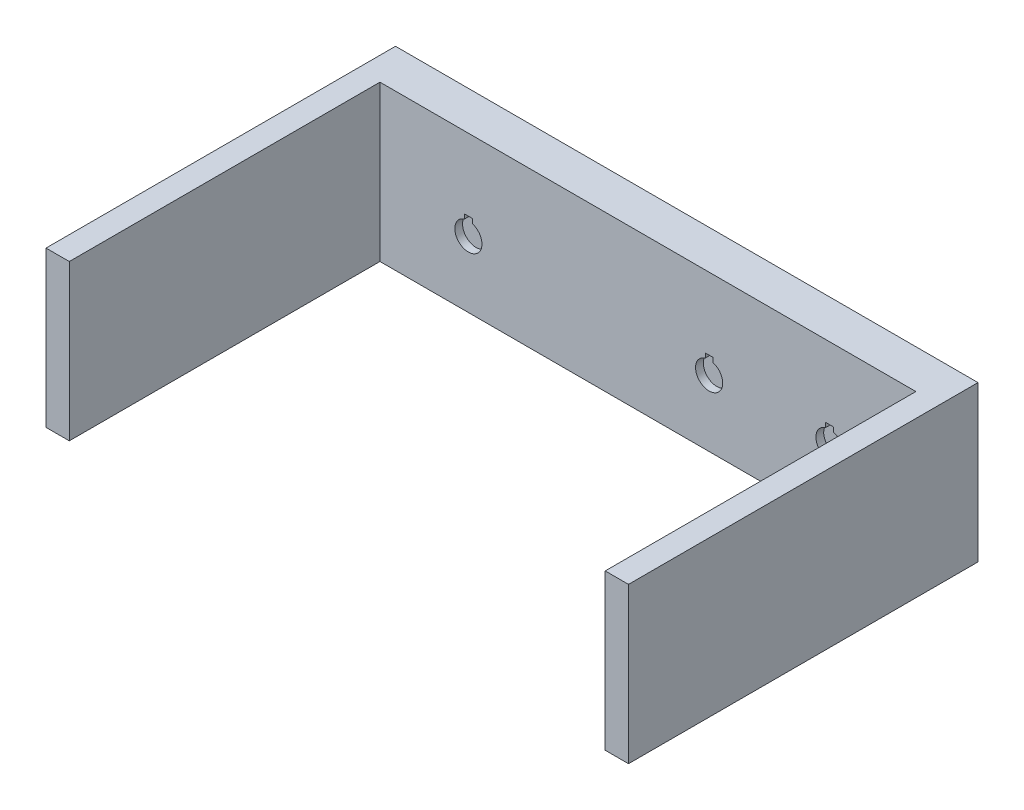
ISO-10303-21;
HEADER;
FILE_DESCRIPTION(('STEP AP214'),'2;1');
FILE_NAME('part.step','',(''),(''),'','','');
FILE_SCHEMA(('AUTOMOTIVE_DESIGN { 1 0 10303 214 1 1 1 1 }'));
ENDSEC;
DATA;
#1=APPLICATION_CONTEXT('core data for automotive mechanical design processes');
#2=APPLICATION_PROTOCOL_DEFINITION('international standard','automotive_design',2000,#1);
#3=PRODUCT_CONTEXT('',#1,'mechanical');
#4=PRODUCT('Part','Part','',(#3));
#5=PRODUCT_RELATED_PRODUCT_CATEGORY('part','',(#4));
#6=PRODUCT_DEFINITION_FORMATION('','',#4);
#7=PRODUCT_DEFINITION_CONTEXT('part definition',#1,'design');
#8=PRODUCT_DEFINITION('design','',#6,#7);
#9=PRODUCT_DEFINITION_SHAPE('','',#8);
#10=(LENGTH_UNIT() NAMED_UNIT(*) SI_UNIT(.MILLI.,.METRE.));
#11=(NAMED_UNIT(*) PLANE_ANGLE_UNIT() SI_UNIT($,.RADIAN.));
#12=(NAMED_UNIT(*) SI_UNIT($,.STERADIAN.) SOLID_ANGLE_UNIT());
#13=UNCERTAINTY_MEASURE_WITH_UNIT(LENGTH_MEASURE(1.E-05),#10,'distance_accuracy_value','');
#14=(GEOMETRIC_REPRESENTATION_CONTEXT(3) GLOBAL_UNCERTAINTY_ASSIGNED_CONTEXT((#13)) GLOBAL_UNIT_ASSIGNED_CONTEXT((#10,
#11,#12)) REPRESENTATION_CONTEXT('',''));
#15=CARTESIAN_POINT('',(0.,0.,0.));
#16=DIRECTION('',(0.,0.,1.));
#17=DIRECTION('',(1.,0.,0.));
#18=AXIS2_PLACEMENT_3D('',#15,#16,#17);
#19=CARTESIAN_POINT('',(0.,0.,10.));
#20=DIRECTION('',(0.,0.,1.));
#21=DIRECTION('',(1.,0.,0.));
#22=AXIS2_PLACEMENT_3D('',#19,#20,#21);
#23=PLANE('',#22);
#24=DIRECTION('',(0.,-1.,0.));
#25=VECTOR('',#24,1.);
#26=CARTESIAN_POINT('',(-47.2341755128517,1.50410196624967,10.));
#27=LINE('',#26,#25);
#28=CARTESIAN_POINT('',(-47.2341755128517,1.50410196624967,10.));
#29=VERTEX_POINT('',#28);
#30=CARTESIAN_POINT('',(-47.2341755128517,0.354101966249675,10.));
#31=VERTEX_POINT('',#30);
#32=EDGE_CURVE('E252',#29,#31,#27,.T.);
#33=ORIENTED_EDGE('',*,*,#32,.F.);
#34=DIRECTION('',(-1.,0.,0.));
#35=VECTOR('',#34,1.);
#36=CARTESIAN_POINT('',(-45.2341755128517,1.50410196624968,10.));
#37=LINE('',#36,#35);
#38=CARTESIAN_POINT('',(-45.2341755128517,1.50410196624968,10.));
#39=VERTEX_POINT('',#38);
#40=EDGE_CURVE('E251',#39,#29,#37,.T.);
#41=ORIENTED_EDGE('',*,*,#40,.F.);
#42=DIRECTION('',(0.,-1.,0.));
#43=VECTOR('',#42,1.);
#44=CARTESIAN_POINT('',(-45.2341755128517,1.50410196624968,10.));
#45=LINE('',#44,#43);
#46=CARTESIAN_POINT('',(-45.2341755128517,0.354101966249675,10.));
#47=VERTEX_POINT('',#46);
#48=EDGE_CURVE('E258',#39,#47,#45,.T.);
#49=ORIENTED_EDGE('',*,*,#48,.T.);
#50=CARTESIAN_POINT('',(-46.2341755128517,-3.00000000000001,10.));
#51=DIRECTION('',(0.,0.,1.));
#52=DIRECTION('',(1.,0.,0.));
#53=AXIS2_PLACEMENT_3D('',#50,#51,#52);
#54=CIRCLE('',#53,3.5);
#55=EDGE_CURVE('E254',#31,#47,#54,.T.);
#56=ORIENTED_EDGE('',*,*,#55,.F.);
#57=EDGE_LOOP('',(#33,#41,#49,#56));
#58=FACE_BOUND('',#57,.T.);
#59=DIRECTION('',(-1.,0.,0.));
#60=VECTOR('',#59,1.);
#61=CARTESIAN_POINT('',(16.7658244871483,1.50410196624968,10.));
#62=LINE('',#61,#60);
#63=CARTESIAN_POINT('',(16.7658244871483,1.50410196624968,10.));
#64=VERTEX_POINT('',#63);
#65=CARTESIAN_POINT('',(14.7658244871483,1.50410196624967,10.));
#66=VERTEX_POINT('',#65);
#67=EDGE_CURVE('E255',#64,#66,#62,.T.);
#68=ORIENTED_EDGE('',*,*,#67,.F.);
#69=DIRECTION('',(0.,-1.,0.));
#70=VECTOR('',#69,1.);
#71=CARTESIAN_POINT('',(16.7658244871483,1.50410196624968,10.));
#72=LINE('',#71,#70);
#73=CARTESIAN_POINT('',(16.7658244871483,0.354101966249675,10.));
#74=VERTEX_POINT('',#73);
#75=EDGE_CURVE('E283',#64,#74,#72,.T.);
#76=ORIENTED_EDGE('',*,*,#75,.T.);
#77=CARTESIAN_POINT('',(15.7658244871483,-3.00000000000001,10.));
#78=DIRECTION('',(0.,0.,1.));
#79=DIRECTION('',(1.,0.,0.));
#80=AXIS2_PLACEMENT_3D('',#77,#78,#79);
#81=CIRCLE('',#80,3.5);
#82=CARTESIAN_POINT('',(14.7658244871483,0.354101966249675,10.));
#83=VERTEX_POINT('',#82);
#84=EDGE_CURVE('E286',#83,#74,#81,.T.);
#85=ORIENTED_EDGE('',*,*,#84,.F.);
#86=DIRECTION('',(0.,-1.,0.));
#87=VECTOR('',#86,1.);
#88=CARTESIAN_POINT('',(14.7658244871483,1.50410196624967,10.));
#89=LINE('',#88,#87);
#90=EDGE_CURVE('E289',#66,#83,#89,.T.);
#91=ORIENTED_EDGE('',*,*,#90,.F.);
#92=EDGE_LOOP('',(#68,#76,#85,#91));
#93=FACE_BOUND('',#92,.T.);
#94=DIRECTION('',(-1.,0.,0.));
#95=VECTOR('',#94,1.);
#96=CARTESIAN_POINT('',(47.7658244871483,1.50410196624968,10.));
#97=LINE('',#96,#95);
#98=CARTESIAN_POINT('',(47.7658244871483,1.50410196624968,10.));
#99=VERTEX_POINT('',#98);
#100=CARTESIAN_POINT('',(45.7658244871483,1.50410196624967,10.));
#101=VERTEX_POINT('',#100);
#102=EDGE_CURVE('E282',#99,#101,#97,.T.);
#103=ORIENTED_EDGE('',*,*,#102,.F.);
#104=DIRECTION('',(0.,-1.,0.));
#105=VECTOR('',#104,1.);
#106=CARTESIAN_POINT('',(47.7658244871483,1.50410196624968,10.));
#107=LINE('',#106,#105);
#108=CARTESIAN_POINT('',(47.7658244871483,0.354101966249675,10.));
#109=VERTEX_POINT('',#108);
#110=EDGE_CURVE('E304',#99,#109,#107,.T.);
#111=ORIENTED_EDGE('',*,*,#110,.T.);
#112=CARTESIAN_POINT('',(46.7658244871483,-3.00000000000001,10.));
#113=DIRECTION('',(0.,0.,1.));
#114=DIRECTION('',(1.,0.,0.));
#115=AXIS2_PLACEMENT_3D('',#112,#113,#114);
#116=CIRCLE('',#115,3.5);
#117=CARTESIAN_POINT('',(45.7658244871483,0.354101966249675,10.));
#118=VERTEX_POINT('',#117);
#119=EDGE_CURVE('E307',#118,#109,#116,.T.);
#120=ORIENTED_EDGE('',*,*,#119,.F.);
#121=DIRECTION('',(0.,-1.,0.));
#122=VECTOR('',#121,1.);
#123=CARTESIAN_POINT('',(45.7658244871483,1.50410196624967,10.));
#124=LINE('',#123,#122);
#125=EDGE_CURVE('E310',#101,#118,#124,.T.);
#126=ORIENTED_EDGE('',*,*,#125,.F.);
#127=EDGE_LOOP('',(#103,#111,#120,#126));
#128=FACE_BOUND('',#127,.T.);
#129=DIRECTION('',(1.,0.,0.));
#130=VECTOR('',#129,1.);
#131=CARTESIAN_POINT('',(75.,-20.,10.));
#132=LINE('',#131,#130);
#133=CARTESIAN_POINT('',(-69.,-20.,10.));
#134=VERTEX_POINT('',#133);
#135=CARTESIAN_POINT('',(69.,-20.,10.));
#136=VERTEX_POINT('',#135);
#137=EDGE_CURVE('E53',#134,#136,#132,.T.);
#138=ORIENTED_EDGE('',*,*,#137,.T.);
#139=DIRECTION('',(0.,-1.,0.));
#140=VECTOR('',#139,1.);
#141=CARTESIAN_POINT('',(69.,20.,10.));
#142=LINE('',#141,#140);
#143=CARTESIAN_POINT('',(69.,20.,10.));
#144=VERTEX_POINT('',#143);
#145=EDGE_CURVE('E48',#144,#136,#142,.T.);
#146=ORIENTED_EDGE('',*,*,#145,.F.);
#147=DIRECTION('',(-1.,0.,0.));
#148=VECTOR('',#147,1.);
#149=CARTESIAN_POINT('',(75.,20.,10.));
#150=LINE('',#149,#148);
#151=CARTESIAN_POINT('',(-69.,20.,10.));
#152=VERTEX_POINT('',#151);
#153=EDGE_CURVE('E383',#144,#152,#150,.T.);
#154=ORIENTED_EDGE('',*,*,#153,.T.);
#155=DIRECTION('',(0.,1.,0.));
#156=VECTOR('',#155,1.);
#157=CARTESIAN_POINT('',(-69.,20.,10.));
#158=LINE('',#157,#156);
#159=EDGE_CURVE('E227',#134,#152,#158,.T.);
#160=ORIENTED_EDGE('',*,*,#159,.F.);
#161=EDGE_LOOP('',(#138,#146,#154,#160));
#162=FACE_BOUND('',#161,.T.);
#163=ADVANCED_FACE('F33',(#58,#93,#128,#162),#23,.T.);
#164=CARTESIAN_POINT('',(-75.,-20.,10.));
#165=DIRECTION('',(1.,0.,0.));
#166=DIRECTION('',(0.,0.,-1.));
#167=AXIS2_PLACEMENT_3D('',#164,#165,#166);
#168=PLANE('',#167);
#169=DIRECTION('',(0.,-1.,0.));
#170=VECTOR('',#169,1.);
#171=CARTESIAN_POINT('',(-75.,-20.,0.));
#172=LINE('',#171,#170);
#173=CARTESIAN_POINT('',(-75.,20.,0.));
#174=VERTEX_POINT('',#173);
#175=CARTESIAN_POINT('',(-75.,-20.,0.));
#176=VERTEX_POINT('',#175);
#177=EDGE_CURVE('E375',#174,#176,#172,.T.);
#178=ORIENTED_EDGE('',*,*,#177,.T.);
#179=DIRECTION('',(0.,0.,-1.));
#180=VECTOR('',#179,1.);
#181=CARTESIAN_POINT('',(-75.,-20.,10.));
#182=LINE('',#181,#180);
#183=CARTESIAN_POINT('',(-75.,-20.,90.));
#184=VERTEX_POINT('',#183);
#185=EDGE_CURVE('E395',#184,#176,#182,.T.);
#186=ORIENTED_EDGE('',*,*,#185,.F.);
#187=DIRECTION('',(0.,-1.,0.));
#188=VECTOR('',#187,1.);
#189=CARTESIAN_POINT('',(-75.,20.,90.));
#190=LINE('',#189,#188);
#191=CARTESIAN_POINT('',(-75.,20.,90.));
#192=VERTEX_POINT('',#191);
#193=EDGE_CURVE('E228',#192,#184,#190,.T.);
#194=ORIENTED_EDGE('',*,*,#193,.F.);
#195=DIRECTION('',(0.,0.,-1.));
#196=VECTOR('',#195,1.);
#197=CARTESIAN_POINT('',(-75.,20.,10.));
#198=LINE('',#197,#196);
#199=EDGE_CURVE('E203',#192,#174,#198,.T.);
#200=ORIENTED_EDGE('',*,*,#199,.T.);
#201=EDGE_LOOP('',(#178,#186,#194,#200));
#202=FACE_BOUND('',#201,.T.);
#203=ADVANCED_FACE('F35',(#202),#168,.F.);
#204=CARTESIAN_POINT('',(75.,-20.,10.));
#205=DIRECTION('',(0.,1.,0.));
#206=DIRECTION('',(-1.,0.,0.));
#207=AXIS2_PLACEMENT_3D('',#204,#205,#206);
#208=PLANE('',#207);
#209=DIRECTION('',(1.,0.,0.));
#210=VECTOR('',#209,1.);
#211=CARTESIAN_POINT('',(65.2658244871483,-20.,2.00000000000001));
#212=LINE('',#211,#210);
#213=CARTESIAN_POINT('',(-64.7341755128516,-20.,1.99999999999999));
#214=VERTEX_POINT('',#213);
#215=CARTESIAN_POINT('',(65.2658244871483,-20.,2.00000000000001));
#216=VERTEX_POINT('',#215);
#217=EDGE_CURVE('E365',#214,#216,#212,.T.);
#218=ORIENTED_EDGE('',*,*,#217,.F.);
#219=DIRECTION('',(0.,0.,-1.));
#220=VECTOR('',#219,1.);
#221=CARTESIAN_POINT('',(-64.7341755128517,-20.,1.99999999999999));
#222=LINE('',#221,#220);
#223=CARTESIAN_POINT('',(-64.7341755128517,-20.,7.99999999999999));
#224=VERTEX_POINT('',#223);
#225=EDGE_CURVE('E349',#224,#214,#222,.T.);
#226=ORIENTED_EDGE('',*,*,#225,.F.);
#227=DIRECTION('',(-1.,0.,0.));
#228=VECTOR('',#227,1.);
#229=CARTESIAN_POINT('',(65.2658244871483,-20.,8.00000000000001));
#230=LINE('',#229,#228);
#231=CARTESIAN_POINT('',(65.2658244871483,-20.,8.00000000000001));
#232=VERTEX_POINT('',#231);
#233=EDGE_CURVE('E354',#232,#224,#230,.T.);
#234=ORIENTED_EDGE('',*,*,#233,.F.);
#235=DIRECTION('',(0.,0.,1.));
#236=VECTOR('',#235,1.);
#237=CARTESIAN_POINT('',(65.2658244871483,-20.,2.00000000000001));
#238=LINE('',#237,#236);
#239=EDGE_CURVE('E368',#216,#232,#238,.T.);
#240=ORIENTED_EDGE('',*,*,#239,.F.);
#241=EDGE_LOOP('',(#218,#226,#234,#240));
#242=FACE_BOUND('',#241,.T.);
#243=DIRECTION('',(1.,0.,0.));
#244=VECTOR('',#243,1.);
#245=CARTESIAN_POINT('',(75.,-20.,0.));
#246=LINE('',#245,#244);
#247=CARTESIAN_POINT('',(75.,-20.,0.));
#248=VERTEX_POINT('',#247);
#249=EDGE_CURVE('E388',#176,#248,#246,.T.);
#250=ORIENTED_EDGE('',*,*,#249,.T.);
#251=DIRECTION('',(0.,0.,-1.));
#252=VECTOR('',#251,1.);
#253=CARTESIAN_POINT('',(75.,-20.,10.));
#254=LINE('',#253,#252);
#255=CARTESIAN_POINT('',(75.,-20.,90.));
#256=VERTEX_POINT('',#255);
#257=EDGE_CURVE('E202',#256,#248,#254,.T.);
#258=ORIENTED_EDGE('',*,*,#257,.F.);
#259=DIRECTION('',(1.,0.,0.));
#260=VECTOR('',#259,1.);
#261=CARTESIAN_POINT('',(75.,-20.,90.));
#262=LINE('',#261,#260);
#263=CARTESIAN_POINT('',(69.,-20.,90.));
#264=VERTEX_POINT('',#263);
#265=EDGE_CURVE('E217',#264,#256,#262,.T.);
#266=ORIENTED_EDGE('',*,*,#265,.F.);
#267=DIRECTION('',(0.,0.,-1.));
#268=VECTOR('',#267,1.);
#269=CARTESIAN_POINT('',(69.,-20.,90.));
#270=LINE('',#269,#268);
#271=EDGE_CURVE('E222',#264,#136,#270,.T.);
#272=ORIENTED_EDGE('',*,*,#271,.T.);
#273=ORIENTED_EDGE('',*,*,#137,.F.);
#274=DIRECTION('',(0.,0.,-1.));
#275=VECTOR('',#274,1.);
#276=CARTESIAN_POINT('',(-69.,-20.,90.));
#277=LINE('',#276,#275);
#278=CARTESIAN_POINT('',(-69.,-20.,90.));
#279=VERTEX_POINT('',#278);
#280=EDGE_CURVE('E243',#279,#134,#277,.T.);
#281=ORIENTED_EDGE('',*,*,#280,.F.);
#282=DIRECTION('',(1.,0.,0.));
#283=VECTOR('',#282,1.);
#284=CARTESIAN_POINT('',(-75.,-20.,90.));
#285=LINE('',#284,#283);
#286=EDGE_CURVE('E231',#184,#279,#285,.T.);
#287=ORIENTED_EDGE('',*,*,#286,.F.);
#288=ORIENTED_EDGE('',*,*,#185,.T.);
#289=EDGE_LOOP('',(#250,#258,#266,#272,#273,#281,#287,#288));
#290=FACE_BOUND('',#289,.T.);
#291=ADVANCED_FACE('F439',(#242,#290),#208,.F.);
#292=CARTESIAN_POINT('',(75.,-20.,10.));
#293=DIRECTION('',(-1.,0.,0.));
#294=DIRECTION('',(0.,0.,1.));
#295=AXIS2_PLACEMENT_3D('',#292,#293,#294);
#296=PLANE('',#295);
#297=DIRECTION('',(0.,1.,0.));
#298=VECTOR('',#297,1.);
#299=CARTESIAN_POINT('',(75.,-20.,0.));
#300=LINE('',#299,#298);
#301=CARTESIAN_POINT('',(75.,20.,0.));
#302=VERTEX_POINT('',#301);
#303=EDGE_CURVE('E199',#248,#302,#300,.T.);
#304=ORIENTED_EDGE('',*,*,#303,.T.);
#305=DIRECTION('',(0.,0.,-1.));
#306=VECTOR('',#305,1.);
#307=CARTESIAN_POINT('',(75.,20.,10.));
#308=LINE('',#307,#306);
#309=CARTESIAN_POINT('',(75.,20.,90.));
#310=VERTEX_POINT('',#309);
#311=EDGE_CURVE('E192',#310,#302,#308,.T.);
#312=ORIENTED_EDGE('',*,*,#311,.F.);
#313=DIRECTION('',(0.,1.,0.));
#314=VECTOR('',#313,1.);
#315=CARTESIAN_POINT('',(75.,20.,90.));
#316=LINE('',#315,#314);
#317=EDGE_CURVE('E197',#256,#310,#316,.T.);
#318=ORIENTED_EDGE('',*,*,#317,.F.);
#319=ORIENTED_EDGE('',*,*,#257,.T.);
#320=EDGE_LOOP('',(#304,#312,#318,#319));
#321=FACE_BOUND('',#320,.T.);
#322=ADVANCED_FACE('F194',(#321),#296,.F.);
#323=CARTESIAN_POINT('',(75.,20.,10.));
#324=DIRECTION('',(0.,-1.,0.));
#325=DIRECTION('',(1.,0.,0.));
#326=AXIS2_PLACEMENT_3D('',#323,#324,#325);
#327=PLANE('',#326);
#328=DIRECTION('',(-1.,0.,0.));
#329=VECTOR('',#328,1.);
#330=CARTESIAN_POINT('',(75.,20.,0.));
#331=LINE('',#330,#329);
#332=EDGE_CURVE('E384',#302,#174,#331,.T.);
#333=ORIENTED_EDGE('',*,*,#332,.T.);
#334=ORIENTED_EDGE('',*,*,#199,.F.);
#335=DIRECTION('',(-1.,0.,0.));
#336=VECTOR('',#335,1.);
#337=CARTESIAN_POINT('',(-75.,20.,90.));
#338=LINE('',#337,#336);
#339=CARTESIAN_POINT('',(-69.,20.,90.));
#340=VERTEX_POINT('',#339);
#341=EDGE_CURVE('E235',#340,#192,#338,.T.);
#342=ORIENTED_EDGE('',*,*,#341,.F.);
#343=DIRECTION('',(0.,0.,-1.));
#344=VECTOR('',#343,1.);
#345=CARTESIAN_POINT('',(-69.,20.,90.));
#346=LINE('',#345,#344);
#347=EDGE_CURVE('E238',#340,#152,#346,.T.);
#348=ORIENTED_EDGE('',*,*,#347,.T.);
#349=ORIENTED_EDGE('',*,*,#153,.F.);
#350=DIRECTION('',(0.,0.,-1.));
#351=VECTOR('',#350,1.);
#352=CARTESIAN_POINT('',(69.,20.,90.));
#353=LINE('',#352,#351);
#354=CARTESIAN_POINT('',(69.,20.,90.));
#355=VERTEX_POINT('',#354);
#356=EDGE_CURVE('E209',#355,#144,#353,.T.);
#357=ORIENTED_EDGE('',*,*,#356,.F.);
#358=DIRECTION('',(-1.,0.,0.));
#359=VECTOR('',#358,1.);
#360=CARTESIAN_POINT('',(75.,20.,90.));
#361=LINE('',#360,#359);
#362=EDGE_CURVE('E206',#310,#355,#361,.T.);
#363=ORIENTED_EDGE('',*,*,#362,.F.);
#364=ORIENTED_EDGE('',*,*,#311,.T.);
#365=EDGE_LOOP('',(#333,#334,#342,#348,#349,#357,#363,#364));
#366=FACE_BOUND('',#365,.T.);
#367=ADVANCED_FACE('F207',(#366),#327,.F.);
#368=CARTESIAN_POINT('',(0.,0.,0.));
#369=DIRECTION('',(0.,0.,1.));
#370=DIRECTION('',(1.,0.,0.));
#371=AXIS2_PLACEMENT_3D('',#368,#369,#370);
#372=PLANE('',#371);
#373=CARTESIAN_POINT('',(-46.2341755128517,-3.00000000000001,0.));
#374=DIRECTION('',(0.,0.,1.));
#375=DIRECTION('',(1.,0.,0.));
#376=AXIS2_PLACEMENT_3D('',#373,#374,#375);
#377=CIRCLE('',#376,3.5);
#378=CARTESIAN_POINT('',(-42.7341755128517,-3.00000000000001,0.));
#379=VERTEX_POINT('',#378);
#380=EDGE_CURVE('E247',#379,#379,#377,.T.);
#381=ORIENTED_EDGE('',*,*,#380,.T.);
#382=EDGE_LOOP('',(#381));
#383=FACE_BOUND('',#382,.T.);
#384=CARTESIAN_POINT('',(15.7658244871483,-3.00000000000001,0.));
#385=DIRECTION('',(0.,0.,1.));
#386=DIRECTION('',(1.,0.,0.));
#387=AXIS2_PLACEMENT_3D('',#384,#385,#386);
#388=CIRCLE('',#387,3.5);
#389=CARTESIAN_POINT('',(19.2658244871483,-3.00000000000001,0.));
#390=VERTEX_POINT('',#389);
#391=EDGE_CURVE('E275',#390,#390,#388,.T.);
#392=ORIENTED_EDGE('',*,*,#391,.T.);
#393=EDGE_LOOP('',(#392));
#394=FACE_BOUND('',#393,.T.);
#395=CARTESIAN_POINT('',(46.7658244871483,-3.00000000000001,0.));
#396=DIRECTION('',(0.,0.,1.));
#397=DIRECTION('',(1.,0.,0.));
#398=AXIS2_PLACEMENT_3D('',#395,#396,#397);
#399=CIRCLE('',#398,3.5);
#400=CARTESIAN_POINT('',(50.2658244871483,-3.00000000000001,0.));
#401=VERTEX_POINT('',#400);
#402=EDGE_CURVE('E298',#401,#401,#399,.T.);
#403=ORIENTED_EDGE('',*,*,#402,.T.);
#404=EDGE_LOOP('',(#403));
#405=FACE_BOUND('',#404,.T.);
#406=ORIENTED_EDGE('',*,*,#177,.F.);
#407=ORIENTED_EDGE('',*,*,#332,.F.);
#408=ORIENTED_EDGE('',*,*,#303,.F.);
#409=ORIENTED_EDGE('',*,*,#249,.F.);
#410=EDGE_LOOP('',(#406,#407,#408,#409));
#411=FACE_BOUND('',#410,.T.);
#412=ADVANCED_FACE('F415',(#383,#394,#405,#411),#372,.F.);
#413=CARTESIAN_POINT('',(-64.7341755128517,14.,1.99999999999999));
#414=DIRECTION('',(-1.,0.,0.));
#415=DIRECTION('',(0.,-1.,0.));
#416=AXIS2_PLACEMENT_3D('',#413,#414,#415);
#417=PLANE('',#416);
#418=ORIENTED_EDGE('',*,*,#225,.T.);
#419=DIRECTION('',(0.,-1.,0.));
#420=VECTOR('',#419,1.);
#421=CARTESIAN_POINT('',(-64.7341755128517,14.,1.99999999999999));
#422=LINE('',#421,#420);
#423=CARTESIAN_POINT('',(-64.7341755128517,14.,1.99999999999999));
#424=VERTEX_POINT('',#423);
#425=EDGE_CURVE('E363',#424,#214,#422,.T.);
#426=ORIENTED_EDGE('',*,*,#425,.F.);
#427=DIRECTION('',(0.,0.,-1.));
#428=VECTOR('',#427,1.);
#429=CARTESIAN_POINT('',(-64.7341755128517,14.,1.99999999999999));
#430=LINE('',#429,#428);
#431=CARTESIAN_POINT('',(-64.7341755128517,14.,7.99999999999999));
#432=VERTEX_POINT('',#431);
#433=EDGE_CURVE('E350',#432,#424,#430,.T.);
#434=ORIENTED_EDGE('',*,*,#433,.F.);
#435=DIRECTION('',(0.,-1.,0.));
#436=VECTOR('',#435,1.);
#437=CARTESIAN_POINT('',(-64.7341755128517,14.,7.99999999999999));
#438=LINE('',#437,#436);
#439=EDGE_CURVE('E373',#432,#224,#438,.T.);
#440=ORIENTED_EDGE('',*,*,#439,.T.);
#441=EDGE_LOOP('',(#418,#426,#434,#440));
#442=FACE_BOUND('',#441,.T.);
#443=ADVANCED_FACE('F418',(#442),#417,.F.);
#444=CARTESIAN_POINT('',(65.2658244871483,14.,8.00000000000001));
#445=DIRECTION('',(0.,0.,1.));
#446=DIRECTION('',(1.,0.,0.));
#447=AXIS2_PLACEMENT_3D('',#444,#445,#446);
#448=PLANE('',#447);
#449=DIRECTION('',(-1.,0.,0.));
#450=VECTOR('',#449,1.);
#451=CARTESIAN_POINT('',(65.2658244871483,1.50410196624969,8.00000000000001));
#452=LINE('',#451,#450);
#453=CARTESIAN_POINT('',(-45.2341755128517,1.50410196624968,7.99999999999999));
#454=VERTEX_POINT('',#453);
#455=CARTESIAN_POINT('',(-47.2341755128517,1.50410196624967,7.99999999999999));
#456=VERTEX_POINT('',#455);
#457=EDGE_CURVE('E343',#454,#456,#452,.T.);
#458=ORIENTED_EDGE('',*,*,#457,.T.);
#459=DIRECTION('',(0.,-1.,0.));
#460=VECTOR('',#459,1.);
#461=CARTESIAN_POINT('',(-47.2341755128517,14.,7.99999999999999));
#462=LINE('',#461,#460);
#463=CARTESIAN_POINT('',(-47.2341755128517,0.354101966249675,7.99999999999999));
#464=VERTEX_POINT('',#463);
#465=EDGE_CURVE('E346',#456,#464,#462,.T.);
#466=ORIENTED_EDGE('',*,*,#465,.T.);
#467=CARTESIAN_POINT('',(-46.2341755128517,-3.00000000000001,7.99999999999999));
#468=DIRECTION('',(0.,0.,1.));
#469=DIRECTION('',(1.,0.,0.));
#470=AXIS2_PLACEMENT_3D('',#467,#468,#469);
#471=CIRCLE('',#470,3.5);
#472=CARTESIAN_POINT('',(-45.2341755128517,0.354101966249675,7.99999999999999));
#473=VERTEX_POINT('',#472);
#474=EDGE_CURVE('E337',#464,#473,#471,.T.);
#475=ORIENTED_EDGE('',*,*,#474,.T.);
#476=DIRECTION('',(0.,-1.,0.));
#477=VECTOR('',#476,1.);
#478=CARTESIAN_POINT('',(-45.2341755128517,14.,7.99999999999999));
#479=LINE('',#478,#477);
#480=EDGE_CURVE('E340',#454,#473,#479,.T.);
#481=ORIENTED_EDGE('',*,*,#480,.F.);
#482=EDGE_LOOP('',(#458,#466,#475,#481));
#483=FACE_BOUND('',#482,.T.);
#484=DIRECTION('',(0.,-1.,0.));
#485=VECTOR('',#484,1.);
#486=CARTESIAN_POINT('',(16.7658244871483,14.,8.));
#487=LINE('',#486,#485);
#488=CARTESIAN_POINT('',(16.7658244871483,1.50410196624968,8.));
#489=VERTEX_POINT('',#488);
#490=CARTESIAN_POINT('',(16.7658244871483,0.354101966249675,8.));
#491=VERTEX_POINT('',#490);
#492=EDGE_CURVE('E332',#489,#491,#487,.T.);
#493=ORIENTED_EDGE('',*,*,#492,.F.);
#494=DIRECTION('',(-1.,0.,0.));
#495=VECTOR('',#494,1.);
#496=CARTESIAN_POINT('',(65.2658244871483,1.50410196624968,8.00000000000001));
#497=LINE('',#496,#495);
#498=CARTESIAN_POINT('',(14.7658244871483,1.50410196624967,8.));
#499=VERTEX_POINT('',#498);
#500=EDGE_CURVE('E334',#489,#499,#497,.T.);
#501=ORIENTED_EDGE('',*,*,#500,.T.);
#502=DIRECTION('',(0.,-1.,0.));
#503=VECTOR('',#502,1.);
#504=CARTESIAN_POINT('',(14.7658244871483,14.,8.));
#505=LINE('',#504,#503);
#506=CARTESIAN_POINT('',(14.7658244871483,0.354101966249675,8.));
#507=VERTEX_POINT('',#506);
#508=EDGE_CURVE('E326',#499,#507,#505,.T.);
#509=ORIENTED_EDGE('',*,*,#508,.T.);
#510=CARTESIAN_POINT('',(15.7658244871483,-3.00000000000001,8.));
#511=DIRECTION('',(0.,0.,1.));
#512=DIRECTION('',(1.,0.,0.));
#513=AXIS2_PLACEMENT_3D('',#510,#511,#512);
#514=CIRCLE('',#513,3.5);
#515=EDGE_CURVE('E329',#507,#491,#514,.T.);
#516=ORIENTED_EDGE('',*,*,#515,.T.);
#517=EDGE_LOOP('',(#493,#501,#509,#516));
#518=FACE_BOUND('',#517,.T.);
#519=DIRECTION('',(0.,-1.,0.));
#520=VECTOR('',#519,1.);
#521=CARTESIAN_POINT('',(47.7658244871483,14.,8.00000000000001));
#522=LINE('',#521,#520);
#523=CARTESIAN_POINT('',(47.7658244871483,1.50410196624968,8.00000000000001));
#524=VERTEX_POINT('',#523);
#525=CARTESIAN_POINT('',(47.7658244871483,0.354101966249675,8.00000000000001));
#526=VERTEX_POINT('',#525);
#527=EDGE_CURVE('E321',#524,#526,#522,.T.);
#528=ORIENTED_EDGE('',*,*,#527,.F.);
#529=DIRECTION('',(-1.,0.,0.));
#530=VECTOR('',#529,1.);
#531=CARTESIAN_POINT('',(65.2658244871483,1.50410196624968,8.00000000000001));
#532=LINE('',#531,#530);
#533=CARTESIAN_POINT('',(45.7658244871483,1.50410196624967,8.));
#534=VERTEX_POINT('',#533);
#535=EDGE_CURVE('E323',#524,#534,#532,.T.);
#536=ORIENTED_EDGE('',*,*,#535,.T.);
#537=DIRECTION('',(0.,-1.,0.));
#538=VECTOR('',#537,1.);
#539=CARTESIAN_POINT('',(45.7658244871483,14.,8.));
#540=LINE('',#539,#538);
#541=CARTESIAN_POINT('',(45.7658244871483,0.354101966249675,8.));
#542=VERTEX_POINT('',#541);
#543=EDGE_CURVE('E265',#534,#542,#540,.T.);
#544=ORIENTED_EDGE('',*,*,#543,.T.);
#545=CARTESIAN_POINT('',(46.7658244871483,-3.00000000000001,8.00000000000001));
#546=DIRECTION('',(0.,0.,1.));
#547=DIRECTION('',(1.,0.,0.));
#548=AXIS2_PLACEMENT_3D('',#545,#546,#547);
#549=CIRCLE('',#548,3.5);
#550=EDGE_CURVE('E318',#542,#526,#549,.T.);
#551=ORIENTED_EDGE('',*,*,#550,.T.);
#552=EDGE_LOOP('',(#528,#536,#544,#551));
#553=FACE_BOUND('',#552,.T.);
#554=ORIENTED_EDGE('',*,*,#233,.T.);
#555=ORIENTED_EDGE('',*,*,#439,.F.);
#556=DIRECTION('',(-1.,0.,0.));
#557=VECTOR('',#556,1.);
#558=CARTESIAN_POINT('',(65.2658244871483,14.,8.00000000000001));
#559=LINE('',#558,#557);
#560=CARTESIAN_POINT('',(65.2658244871483,14.,8.00000000000001));
#561=VERTEX_POINT('',#560);
#562=EDGE_CURVE('E360',#561,#432,#559,.T.);
#563=ORIENTED_EDGE('',*,*,#562,.F.);
#564=DIRECTION('',(0.,-1.,0.));
#565=VECTOR('',#564,1.);
#566=CARTESIAN_POINT('',(65.2658244871483,14.,8.00000000000001));
#567=LINE('',#566,#565);
#568=EDGE_CURVE('E376',#561,#232,#567,.T.);
#569=ORIENTED_EDGE('',*,*,#568,.T.);
#570=EDGE_LOOP('',(#554,#555,#563,#569));
#571=FACE_BOUND('',#570,.T.);
#572=ADVANCED_FACE('F476',(#483,#518,#553,#571),#448,.F.);
#573=CARTESIAN_POINT('',(65.2658244871483,14.,2.00000000000001));
#574=DIRECTION('',(1.,0.,0.));
#575=DIRECTION('',(0.,1.,0.));
#576=AXIS2_PLACEMENT_3D('',#573,#574,#575);
#577=PLANE('',#576);
#578=ORIENTED_EDGE('',*,*,#239,.T.);
#579=ORIENTED_EDGE('',*,*,#568,.F.);
#580=DIRECTION('',(0.,0.,1.));
#581=VECTOR('',#580,1.);
#582=CARTESIAN_POINT('',(65.2658244871483,14.,2.00000000000001));
#583=LINE('',#582,#581);
#584=CARTESIAN_POINT('',(65.2658244871483,14.,2.00000000000001));
#585=VERTEX_POINT('',#584);
#586=EDGE_CURVE('E357',#585,#561,#583,.T.);
#587=ORIENTED_EDGE('',*,*,#586,.F.);
#588=DIRECTION('',(0.,-1.,0.));
#589=VECTOR('',#588,1.);
#590=CARTESIAN_POINT('',(65.2658244871483,14.,2.00000000000001));
#591=LINE('',#590,#589);
#592=EDGE_CURVE('E378',#585,#216,#591,.T.);
#593=ORIENTED_EDGE('',*,*,#592,.T.);
#594=EDGE_LOOP('',(#578,#579,#587,#593));
#595=FACE_BOUND('',#594,.T.);
#596=ADVANCED_FACE('F484',(#595),#577,.F.);
#597=CARTESIAN_POINT('',(65.2658244871483,14.,2.00000000000001));
#598=DIRECTION('',(0.,0.,-1.));
#599=DIRECTION('',(-1.,0.,0.));
#600=AXIS2_PLACEMENT_3D('',#597,#598,#599);
#601=PLANE('',#600);
#602=CARTESIAN_POINT('',(-46.2341755128517,-3.00000000000001,1.99999999999999));
#603=DIRECTION('',(0.,0.,-1.));
#604=DIRECTION('',(-1.,0.,0.));
#605=AXIS2_PLACEMENT_3D('',#602,#603,#604);
#606=CIRCLE('',#605,3.5);
#607=CARTESIAN_POINT('',(-49.7341755128517,-3.00000000000001,1.99999999999999));
#608=VERTEX_POINT('',#607);
#609=EDGE_CURVE('E11',#608,#608,#606,.T.);
#610=ORIENTED_EDGE('',*,*,#609,.T.);
#611=EDGE_LOOP('',(#610));
#612=FACE_BOUND('',#611,.T.);
#613=CARTESIAN_POINT('',(15.7658244871483,-3.00000000000001,2.));
#614=DIRECTION('',(0.,0.,-1.));
#615=DIRECTION('',(-1.,0.,0.));
#616=AXIS2_PLACEMENT_3D('',#613,#614,#615);
#617=CIRCLE('',#616,3.5);
#618=CARTESIAN_POINT('',(12.2658244871483,-3.00000000000001,2.));
#619=VERTEX_POINT('',#618);
#620=EDGE_CURVE('E41',#619,#619,#617,.T.);
#621=ORIENTED_EDGE('',*,*,#620,.T.);
#622=EDGE_LOOP('',(#621));
#623=FACE_BOUND('',#622,.T.);
#624=CARTESIAN_POINT('',(46.7658244871483,-3.00000000000001,2.));
#625=DIRECTION('',(0.,0.,-1.));
#626=DIRECTION('',(-1.,0.,0.));
#627=AXIS2_PLACEMENT_3D('',#624,#625,#626);
#628=CIRCLE('',#627,3.5);
#629=CARTESIAN_POINT('',(43.2658244871483,-3.00000000000001,2.));
#630=VERTEX_POINT('',#629);
#631=EDGE_CURVE('E398',#630,#630,#628,.T.);
#632=ORIENTED_EDGE('',*,*,#631,.T.);
#633=EDGE_LOOP('',(#632));
#634=FACE_BOUND('',#633,.T.);
#635=ORIENTED_EDGE('',*,*,#217,.T.);
#636=ORIENTED_EDGE('',*,*,#592,.F.);
#637=DIRECTION('',(1.,0.,0.));
#638=VECTOR('',#637,1.);
#639=CARTESIAN_POINT('',(65.2658244871483,14.,2.00000000000001));
#640=LINE('',#639,#638);
#641=EDGE_CURVE('E353',#424,#585,#640,.T.);
#642=ORIENTED_EDGE('',*,*,#641,.F.);
#643=ORIENTED_EDGE('',*,*,#425,.T.);
#644=EDGE_LOOP('',(#635,#636,#642,#643));
#645=FACE_BOUND('',#644,.T.);
#646=ADVANCED_FACE('F403',(#612,#623,#634,#645),#601,.F.);
#647=CARTESIAN_POINT('',(0.,14.,0.));
#648=DIRECTION('',(0.,-1.,0.));
#649=DIRECTION('',(1.,0.,0.));
#650=AXIS2_PLACEMENT_3D('',#647,#648,#649);
#651=PLANE('',#650);
#652=ORIENTED_EDGE('',*,*,#433,.T.);
#653=ORIENTED_EDGE('',*,*,#641,.T.);
#654=ORIENTED_EDGE('',*,*,#586,.T.);
#655=ORIENTED_EDGE('',*,*,#562,.T.);
#656=EDGE_LOOP('',(#652,#653,#654,#655));
#657=FACE_BOUND('',#656,.T.);
#658=ADVANCED_FACE('F499',(#657),#651,.T.);
#659=CARTESIAN_POINT('',(46.7658244871483,-3.00000000000001,0.));
#660=DIRECTION('',(0.,0.,1.));
#661=DIRECTION('',(1.,0.,0.));
#662=AXIS2_PLACEMENT_3D('',#659,#660,#661);
#663=CYLINDRICAL_SURFACE('',#662,3.5);
#664=ORIENTED_EDGE('',*,*,#631,.F.);
#665=EDGE_LOOP('',(#664));
#666=FACE_BOUND('',#665,.T.);
#667=ORIENTED_EDGE('',*,*,#402,.F.);
#668=EDGE_LOOP('',(#667));
#669=FACE_BOUND('',#668,.T.);
#670=ADVANCED_FACE('F410',(#666,#669),#663,.F.);
#671=CARTESIAN_POINT('',(15.7658244871483,-3.00000000000001,0.));
#672=DIRECTION('',(0.,0.,1.));
#673=DIRECTION('',(1.,0.,0.));
#674=AXIS2_PLACEMENT_3D('',#671,#672,#673);
#675=CYLINDRICAL_SURFACE('',#674,3.5);
#676=ORIENTED_EDGE('',*,*,#620,.F.);
#677=EDGE_LOOP('',(#676));
#678=FACE_BOUND('',#677,.T.);
#679=ORIENTED_EDGE('',*,*,#391,.F.);
#680=EDGE_LOOP('',(#679));
#681=FACE_BOUND('',#680,.T.);
#682=ADVANCED_FACE('F406',(#678,#681),#675,.F.);
#683=CARTESIAN_POINT('',(-46.2341755128517,-3.00000000000001,0.));
#684=DIRECTION('',(0.,0.,1.));
#685=DIRECTION('',(1.,0.,0.));
#686=AXIS2_PLACEMENT_3D('',#683,#684,#685);
#687=CYLINDRICAL_SURFACE('',#686,3.5);
#688=ORIENTED_EDGE('',*,*,#609,.F.);
#689=EDGE_LOOP('',(#688));
#690=FACE_BOUND('',#689,.T.);
#691=ORIENTED_EDGE('',*,*,#380,.F.);
#692=EDGE_LOOP('',(#691));
#693=FACE_BOUND('',#692,.T.);
#694=ADVANCED_FACE('F409',(#690,#693),#687,.F.);
#695=CARTESIAN_POINT('',(47.7658244871483,1.50410196624968,0.));
#696=DIRECTION('',(0.,1.,0.));
#697=DIRECTION('',(-1.,0.,0.));
#698=AXIS2_PLACEMENT_3D('',#695,#696,#697);
#699=PLANE('',#698);
#700=DIRECTION('',(0.,0.,1.));
#701=VECTOR('',#700,1.);
#702=CARTESIAN_POINT('',(47.7658244871483,1.50410196624968,0.));
#703=LINE('',#702,#701);
#704=EDGE_CURVE('E246',#524,#99,#703,.T.);
#705=ORIENTED_EDGE('',*,*,#704,.T.);
#706=ORIENTED_EDGE('',*,*,#102,.T.);
#707=DIRECTION('',(0.,0.,1.));
#708=VECTOR('',#707,1.);
#709=CARTESIAN_POINT('',(45.7658244871483,1.50410196624967,0.));
#710=LINE('',#709,#708);
#711=EDGE_CURVE('E295',#534,#101,#710,.T.);
#712=ORIENTED_EDGE('',*,*,#711,.F.);
#713=ORIENTED_EDGE('',*,*,#535,.F.);
#714=EDGE_LOOP('',(#705,#706,#712,#713));
#715=FACE_BOUND('',#714,.T.);
#716=ADVANCED_FACE('F524',(#715),#699,.F.);
#717=CARTESIAN_POINT('',(47.7658244871483,1.50410196624968,0.));
#718=DIRECTION('',(-1.,0.,0.));
#719=DIRECTION('',(0.,0.,1.));
#720=AXIS2_PLACEMENT_3D('',#717,#718,#719);
#721=PLANE('',#720);
#722=ORIENTED_EDGE('',*,*,#527,.T.);
#723=DIRECTION('',(0.,0.,1.));
#724=VECTOR('',#723,1.);
#725=CARTESIAN_POINT('',(47.7658244871483,0.354101966249675,0.));
#726=LINE('',#725,#724);
#727=EDGE_CURVE('E301',#526,#109,#726,.T.);
#728=ORIENTED_EDGE('',*,*,#727,.T.);
#729=ORIENTED_EDGE('',*,*,#110,.F.);
#730=ORIENTED_EDGE('',*,*,#704,.F.);
#731=EDGE_LOOP('',(#722,#728,#729,#730));
#732=FACE_BOUND('',#731,.T.);
#733=ADVANCED_FACE('F532',(#732),#721,.T.);
#734=DIRECTION('',(0.,0.,1.));
#735=VECTOR('',#734,1.);
#736=CARTESIAN_POINT('',(45.7658244871483,0.354101966249675,0.));
#737=LINE('',#736,#735);
#738=EDGE_CURVE('E299',#542,#118,#737,.T.);
#739=ORIENTED_EDGE('',*,*,#738,.T.);
#740=ORIENTED_EDGE('',*,*,#119,.T.);
#741=ORIENTED_EDGE('',*,*,#727,.F.);
#742=ORIENTED_EDGE('',*,*,#550,.F.);
#743=EDGE_LOOP('',(#739,#740,#741,#742));
#744=FACE_BOUND('',#743,.T.);
#745=ADVANCED_FACE('F513',(#744),#663,.F.);
#746=CARTESIAN_POINT('',(45.7658244871483,1.50410196624967,0.));
#747=DIRECTION('',(-1.,0.,0.));
#748=DIRECTION('',(0.,0.,1.));
#749=AXIS2_PLACEMENT_3D('',#746,#747,#748);
#750=PLANE('',#749);
#751=ORIENTED_EDGE('',*,*,#711,.T.);
#752=ORIENTED_EDGE('',*,*,#125,.T.);
#753=ORIENTED_EDGE('',*,*,#738,.F.);
#754=ORIENTED_EDGE('',*,*,#543,.F.);
#755=EDGE_LOOP('',(#751,#752,#753,#754));
#756=FACE_BOUND('',#755,.T.);
#757=ADVANCED_FACE('F547',(#756),#750,.F.);
#758=CARTESIAN_POINT('',(16.7658244871483,1.50410196624968,0.));
#759=DIRECTION('',(0.,1.,0.));
#760=DIRECTION('',(-1.,0.,0.));
#761=AXIS2_PLACEMENT_3D('',#758,#759,#760);
#762=PLANE('',#761);
#763=DIRECTION('',(0.,0.,1.));
#764=VECTOR('',#763,1.);
#765=CARTESIAN_POINT('',(16.7658244871483,1.50410196624968,0.));
#766=LINE('',#765,#764);
#767=EDGE_CURVE('E280',#489,#64,#766,.T.);
#768=ORIENTED_EDGE('',*,*,#767,.T.);
#769=ORIENTED_EDGE('',*,*,#67,.T.);
#770=DIRECTION('',(0.,0.,1.));
#771=VECTOR('',#770,1.);
#772=CARTESIAN_POINT('',(14.7658244871483,1.50410196624967,0.));
#773=LINE('',#772,#771);
#774=EDGE_CURVE('E272',#499,#66,#773,.T.);
#775=ORIENTED_EDGE('',*,*,#774,.F.);
#776=ORIENTED_EDGE('',*,*,#500,.F.);
#777=EDGE_LOOP('',(#768,#769,#775,#776));
#778=FACE_BOUND('',#777,.T.);
#779=ADVANCED_FACE('F554',(#778),#762,.F.);
#780=CARTESIAN_POINT('',(16.7658244871483,1.50410196624968,0.));
#781=DIRECTION('',(-1.,0.,0.));
#782=DIRECTION('',(0.,0.,1.));
#783=AXIS2_PLACEMENT_3D('',#780,#781,#782);
#784=PLANE('',#783);
#785=ORIENTED_EDGE('',*,*,#492,.T.);
#786=DIRECTION('',(0.,0.,1.));
#787=VECTOR('',#786,1.);
#788=CARTESIAN_POINT('',(16.7658244871483,0.354101966249675,0.));
#789=LINE('',#788,#787);
#790=EDGE_CURVE('E278',#491,#74,#789,.T.);
#791=ORIENTED_EDGE('',*,*,#790,.T.);
#792=ORIENTED_EDGE('',*,*,#75,.F.);
#793=ORIENTED_EDGE('',*,*,#767,.F.);
#794=EDGE_LOOP('',(#785,#791,#792,#793));
#795=FACE_BOUND('',#794,.T.);
#796=ADVANCED_FACE('F562',(#795),#784,.T.);
#797=DIRECTION('',(0.,0.,1.));
#798=VECTOR('',#797,1.);
#799=CARTESIAN_POINT('',(14.7658244871483,0.354101966249675,0.));
#800=LINE('',#799,#798);
#801=EDGE_CURVE('E276',#507,#83,#800,.T.);
#802=ORIENTED_EDGE('',*,*,#801,.T.);
#803=ORIENTED_EDGE('',*,*,#84,.T.);
#804=ORIENTED_EDGE('',*,*,#790,.F.);
#805=ORIENTED_EDGE('',*,*,#515,.F.);
#806=EDGE_LOOP('',(#802,#803,#804,#805));
#807=FACE_BOUND('',#806,.T.);
#808=ADVANCED_FACE('F412',(#807),#675,.F.);
#809=CARTESIAN_POINT('',(14.7658244871483,1.50410196624967,0.));
#810=DIRECTION('',(-1.,0.,0.));
#811=DIRECTION('',(0.,0.,1.));
#812=AXIS2_PLACEMENT_3D('',#809,#810,#811);
#813=PLANE('',#812);
#814=ORIENTED_EDGE('',*,*,#774,.T.);
#815=ORIENTED_EDGE('',*,*,#90,.T.);
#816=ORIENTED_EDGE('',*,*,#801,.F.);
#817=ORIENTED_EDGE('',*,*,#508,.F.);
#818=EDGE_LOOP('',(#814,#815,#816,#817));
#819=FACE_BOUND('',#818,.T.);
#820=ADVANCED_FACE('F577',(#819),#813,.F.);
#821=CARTESIAN_POINT('',(-47.2341755128517,1.50410196624967,0.));
#822=DIRECTION('',(-1.,0.,0.));
#823=DIRECTION('',(0.,0.,1.));
#824=AXIS2_PLACEMENT_3D('',#821,#822,#823);
#825=PLANE('',#824);
#826=DIRECTION('',(0.,0.,1.));
#827=VECTOR('',#826,1.);
#828=CARTESIAN_POINT('',(-47.2341755128517,1.50410196624967,0.));
#829=LINE('',#828,#827);
#830=EDGE_CURVE('E263',#456,#29,#829,.T.);
#831=ORIENTED_EDGE('',*,*,#830,.T.);
#832=ORIENTED_EDGE('',*,*,#32,.T.);
#833=DIRECTION('',(0.,0.,1.));
#834=VECTOR('',#833,1.);
#835=CARTESIAN_POINT('',(-47.2341755128517,0.354101966249675,0.));
#836=LINE('',#835,#834);
#837=EDGE_CURVE('E250',#464,#31,#836,.T.);
#838=ORIENTED_EDGE('',*,*,#837,.F.);
#839=ORIENTED_EDGE('',*,*,#465,.F.);
#840=EDGE_LOOP('',(#831,#832,#838,#839));
#841=FACE_BOUND('',#840,.T.);
#842=ADVANCED_FACE('F584',(#841),#825,.F.);
#843=CARTESIAN_POINT('',(-45.2341755128517,1.50410196624968,0.));
#844=DIRECTION('',(0.,1.,0.));
#845=DIRECTION('',(-1.,0.,0.));
#846=AXIS2_PLACEMENT_3D('',#843,#844,#845);
#847=PLANE('',#846);
#848=DIRECTION('',(0.,0.,1.));
#849=VECTOR('',#848,1.);
#850=CARTESIAN_POINT('',(-45.2341755128517,1.50410196624968,0.));
#851=LINE('',#850,#849);
#852=EDGE_CURVE('E266',#454,#39,#851,.T.);
#853=ORIENTED_EDGE('',*,*,#852,.T.);
#854=ORIENTED_EDGE('',*,*,#40,.T.);
#855=ORIENTED_EDGE('',*,*,#830,.F.);
#856=ORIENTED_EDGE('',*,*,#457,.F.);
#857=EDGE_LOOP('',(#853,#854,#855,#856));
#858=FACE_BOUND('',#857,.T.);
#859=ADVANCED_FACE('F592',(#858),#847,.F.);
#860=CARTESIAN_POINT('',(-45.2341755128517,1.50410196624968,0.));
#861=DIRECTION('',(-1.,0.,0.));
#862=DIRECTION('',(0.,0.,1.));
#863=AXIS2_PLACEMENT_3D('',#860,#861,#862);
#864=PLANE('',#863);
#865=ORIENTED_EDGE('',*,*,#480,.T.);
#866=DIRECTION('',(0.,0.,1.));
#867=VECTOR('',#866,1.);
#868=CARTESIAN_POINT('',(-45.2341755128517,0.354101966249675,0.));
#869=LINE('',#868,#867);
#870=EDGE_CURVE('E268',#473,#47,#869,.T.);
#871=ORIENTED_EDGE('',*,*,#870,.T.);
#872=ORIENTED_EDGE('',*,*,#48,.F.);
#873=ORIENTED_EDGE('',*,*,#852,.F.);
#874=EDGE_LOOP('',(#865,#871,#872,#873));
#875=FACE_BOUND('',#874,.T.);
#876=ADVANCED_FACE('F600',(#875),#864,.T.);
#877=ORIENTED_EDGE('',*,*,#837,.T.);
#878=ORIENTED_EDGE('',*,*,#55,.T.);
#879=ORIENTED_EDGE('',*,*,#870,.F.);
#880=ORIENTED_EDGE('',*,*,#474,.F.);
#881=EDGE_LOOP('',(#877,#878,#879,#880));
#882=FACE_BOUND('',#881,.T.);
#883=ADVANCED_FACE('F527',(#882),#687,.F.);
#884=CARTESIAN_POINT('',(-69.,20.,90.));
#885=DIRECTION('',(-1.,0.,0.));
#886=DIRECTION('',(0.,0.,1.));
#887=AXIS2_PLACEMENT_3D('',#884,#885,#886);
#888=PLANE('',#887);
#889=ORIENTED_EDGE('',*,*,#159,.T.);
#890=ORIENTED_EDGE('',*,*,#347,.F.);
#891=DIRECTION('',(0.,1.,0.));
#892=VECTOR('',#891,1.);
#893=CARTESIAN_POINT('',(-69.,20.,90.));
#894=LINE('',#893,#892);
#895=EDGE_CURVE('E233',#279,#340,#894,.T.);
#896=ORIENTED_EDGE('',*,*,#895,.F.);
#897=ORIENTED_EDGE('',*,*,#280,.T.);
#898=EDGE_LOOP('',(#889,#890,#896,#897));
#899=FACE_BOUND('',#898,.T.);
#900=ADVANCED_FACE('F434',(#899),#888,.F.);
#901=CARTESIAN_POINT('',(0.,0.,90.));
#902=DIRECTION('',(0.,0.,1.));
#903=DIRECTION('',(1.,0.,0.));
#904=AXIS2_PLACEMENT_3D('',#901,#902,#903);
#905=PLANE('',#904);
#906=ORIENTED_EDGE('',*,*,#193,.T.);
#907=ORIENTED_EDGE('',*,*,#286,.T.);
#908=ORIENTED_EDGE('',*,*,#895,.T.);
#909=ORIENTED_EDGE('',*,*,#341,.T.);
#910=EDGE_LOOP('',(#906,#907,#908,#909));
#911=FACE_BOUND('',#910,.T.);
#912=ADVANCED_FACE('F429',(#911),#905,.T.);
#913=CARTESIAN_POINT('',(69.,20.,90.));
#914=DIRECTION('',(1.,0.,0.));
#915=DIRECTION('',(0.,0.,-1.));
#916=AXIS2_PLACEMENT_3D('',#913,#914,#915);
#917=PLANE('',#916);
#918=ORIENTED_EDGE('',*,*,#145,.T.);
#919=ORIENTED_EDGE('',*,*,#271,.F.);
#920=DIRECTION('',(0.,-1.,0.));
#921=VECTOR('',#920,1.);
#922=CARTESIAN_POINT('',(69.,20.,90.));
#923=LINE('',#922,#921);
#924=EDGE_CURVE('E212',#355,#264,#923,.T.);
#925=ORIENTED_EDGE('',*,*,#924,.F.);
#926=ORIENTED_EDGE('',*,*,#356,.T.);
#927=EDGE_LOOP('',(#918,#919,#925,#926));
#928=FACE_BOUND('',#927,.T.);
#929=ADVANCED_FACE('F436',(#928),#917,.F.);
#930=CARTESIAN_POINT('',(0.,0.,90.));
#931=DIRECTION('',(0.,0.,-1.));
#932=DIRECTION('',(-1.,0.,0.));
#933=AXIS2_PLACEMENT_3D('',#930,#931,#932);
#934=PLANE('',#933);
#935=ORIENTED_EDGE('',*,*,#317,.T.);
#936=ORIENTED_EDGE('',*,*,#362,.T.);
#937=ORIENTED_EDGE('',*,*,#924,.T.);
#938=ORIENTED_EDGE('',*,*,#265,.T.);
#939=EDGE_LOOP('',(#935,#936,#937,#938));
#940=FACE_BOUND('',#939,.T.);
#941=ADVANCED_FACE('F215',(#940),#934,.F.);
#942=CLOSED_SHELL('',(#163,#203,#291,#322,#367,#412,#443,#572,#596,#646,#658,#670,#682,#694,
#716,#733,#745,#757,#779,#796,#808,#820,#842,#859,#876,#883,#900,#912,#929,#941));
#943=MANIFOLD_SOLID_BREP('B2',#942);
#944=ADVANCED_BREP_SHAPE_REPRESENTATION('',(#18,#943),#14);
#945=SHAPE_DEFINITION_REPRESENTATION(#9,#944);
ENDSEC;
END-ISO-10303-21;
